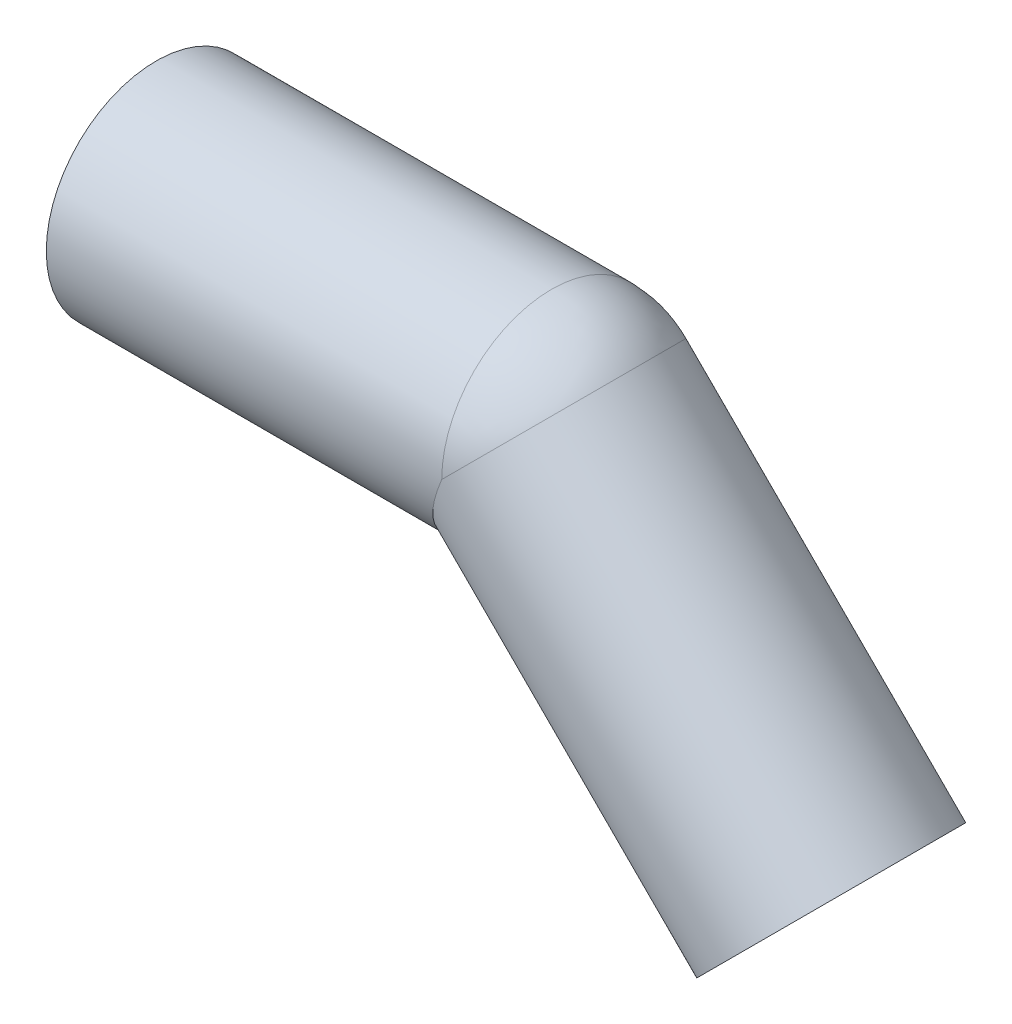
ISO-10303-21;
HEADER;
FILE_DESCRIPTION(('STEP AP214'),'2;1');
FILE_NAME('part.step','',(''),(''),'','','');
FILE_SCHEMA(('AUTOMOTIVE_DESIGN { 1 0 10303 214 1 1 1 1 }'));
ENDSEC;
DATA;
#1=APPLICATION_CONTEXT('core data for automotive mechanical design processes');
#2=APPLICATION_PROTOCOL_DEFINITION('international standard','automotive_design',2000,#1);
#3=PRODUCT_CONTEXT('',#1,'mechanical');
#4=PRODUCT('Part','Part','',(#3));
#5=PRODUCT_RELATED_PRODUCT_CATEGORY('part','',(#4));
#6=PRODUCT_DEFINITION_FORMATION('','',#4);
#7=PRODUCT_DEFINITION_CONTEXT('part definition',#1,'design');
#8=PRODUCT_DEFINITION('design','',#6,#7);
#9=PRODUCT_DEFINITION_SHAPE('','',#8);
#10=(LENGTH_UNIT() NAMED_UNIT(*) SI_UNIT(.MILLI.,.METRE.));
#11=(NAMED_UNIT(*) PLANE_ANGLE_UNIT() SI_UNIT($,.RADIAN.));
#12=(NAMED_UNIT(*) SI_UNIT($,.STERADIAN.) SOLID_ANGLE_UNIT());
#13=UNCERTAINTY_MEASURE_WITH_UNIT(LENGTH_MEASURE(1.E-05),#10,'distance_accuracy_value','');
#14=(GEOMETRIC_REPRESENTATION_CONTEXT(3) GLOBAL_UNCERTAINTY_ASSIGNED_CONTEXT((#13)) GLOBAL_UNIT_ASSIGNED_CONTEXT((#10,
#11,#12)) REPRESENTATION_CONTEXT('',''));
#15=CARTESIAN_POINT('',(0.,0.,0.));
#16=DIRECTION('',(0.,0.,1.));
#17=DIRECTION('',(1.,0.,0.));
#18=AXIS2_PLACEMENT_3D('',#15,#16,#17);
#19=CARTESIAN_POINT('',(76.8198051533945,-31.8198051533949,0.));
#20=DIRECTION('',(-0.70710678118654,0.707106781186555,0.));
#21=DIRECTION('',(-0.707106781186555,-0.70710678118654,0.));
#22=AXIS2_PLACEMENT_3D('',#19,#20,#21);
#23=CYLINDRICAL_SURFACE('',#22,10.6);
#24=CARTESIAN_POINT('',(45.,0.,0.));
#25=DIRECTION('',(0.707106781186547,-0.707106781186548,0.));
#26=DIRECTION('',(0.,0.,-1.));
#27=AXIS2_PLACEMENT_3D('',#24,#25,#26);
#28=CIRCLE('',#27,10.6);
#29=CARTESIAN_POINT('',(52.4953318809489,7.49533188020596,0.));
#30=VERTEX_POINT('',#29);
#31=CARTESIAN_POINT('',(45.0000000000002,-1.07196793468043E-13,10.6));
#32=VERTEX_POINT('',#31);
#33=EDGE_CURVE('E53',#30,#32,#28,.T.);
#34=ORIENTED_EDGE('',*,*,#33,.F.);
#35=CARTESIAN_POINT('',(45.,0.,0.));
#36=DIRECTION('',(0.707106781081423,-0.707106781291672,0.));
#37=DIRECTION('',(0.,0.,-1.));
#38=AXIS2_PLACEMENT_3D('',#35,#36,#37);
#39=CIRCLE('',#38,10.6);
#40=CARTESIAN_POINT('',(45.0000000000003,-1.15468951267044E-13,-10.6));
#41=VERTEX_POINT('',#40);
#42=EDGE_CURVE('E46',#41,#30,#39,.T.);
#43=ORIENTED_EDGE('',*,*,#42,.F.);
#44=CARTESIAN_POINT('',(45.0000000000003,0.,0.));
#45=DIRECTION('',(-0.923879532511285,0.382683432365095,0.));
#46=DIRECTION('',(-0.382683432365095,-0.923879532511285,0.));
#47=AXIS2_PLACEMENT_3D('',#44,#45,#46);
#48=ELLIPSE('',#47,11.4733573230994,10.6);
#49=EDGE_CURVE('E55',#32,#41,#48,.F.);
#50=ORIENTED_EDGE('',*,*,#49,.F.);
#51=EDGE_LOOP('',(#34,#43,#50));
#52=FACE_BOUND('',#51,.T.);
#53=CARTESIAN_POINT('',(76.8198051533943,-31.8198051533947,0.));
#54=DIRECTION('',(-0.70710678118654,0.707106781186555,0.));
#55=DIRECTION('',(-0.707106781186555,-0.70710678118654,0.));
#56=AXIS2_PLACEMENT_3D('',#53,#54,#55);
#57=CIRCLE('',#56,10.6);
#58=CARTESIAN_POINT('',(69.3244732728168,-39.3151370339721,0.));
#59=VERTEX_POINT('',#58);
#60=EDGE_CURVE('E18',#59,#59,#57,.T.);
#61=ORIENTED_EDGE('',*,*,#60,.F.);
#62=EDGE_LOOP('',(#61));
#63=FACE_BOUND('',#62,.T.);
#64=ADVANCED_FACE('F15',(#52,#63),#23,.F.);
#65=CARTESIAN_POINT('',(45.,0.,0.));
#66=DIRECTION('',(0.,0.,1.));
#67=DIRECTION('',(-1.,0.,0.));
#68=AXIS2_PLACEMENT_3D('',#65,#66,#67);
#69=SPHERICAL_SURFACE('',#68,10.6);
#70=CARTESIAN_POINT('',(45.,0.,0.));
#71=DIRECTION('',(-1.,0.,0.));
#72=DIRECTION('',(0.,1.,0.));
#73=AXIS2_PLACEMENT_3D('',#70,#71,#72);
#74=CIRCLE('',#73,10.6);
#75=EDGE_CURVE('E51',#41,#32,#74,.F.);
#76=ORIENTED_EDGE('',*,*,#75,.F.);
#77=ORIENTED_EDGE('',*,*,#42,.T.);
#78=ORIENTED_EDGE('',*,*,#33,.T.);
#79=EDGE_LOOP('',(#76,#77,#78));
#80=FACE_BOUND('',#79,.T.);
#81=ADVANCED_FACE('F58',(#80),#69,.F.);
#82=CARTESIAN_POINT('',(85.6586399182278,-22.9809703885614,12.6500021083315));
#83=DIRECTION('',(0.707106781186547,-0.707106781186548,0.));
#84=DIRECTION('',(-0.707106781186548,-0.707106781186547,0.));
#85=AXIS2_PLACEMENT_3D('',#82,#83,#84);
#86=PLANE('',#85);
#87=ORIENTED_EDGE('',*,*,#60,.T.);
#88=EDGE_LOOP('',(#87));
#89=FACE_BOUND('',#88,.T.);
#90=CARTESIAN_POINT('',(76.8198051533941,-31.8198051533948,0.));
#91=DIRECTION('',(-0.707106781186532,0.707106781186563,0.));
#92=DIRECTION('',(-0.707106781186563,-0.707106781186532,0.));
#93=AXIS2_PLACEMENT_3D('',#90,#91,#92);
#94=CIRCLE('',#93,12.5);
#95=CARTESIAN_POINT('',(67.980970388562,-40.6586399182265,0.));
#96=VERTEX_POINT('',#95);
#97=EDGE_CURVE('E75',#96,#96,#94,.T.);
#98=ORIENTED_EDGE('',*,*,#97,.F.);
#99=EDGE_LOOP('',(#98));
#100=FACE_BOUND('',#99,.T.);
#101=ADVANCED_FACE('F85',(#89,#100),#86,.T.);
#102=CARTESIAN_POINT('',(45.,0.,0.));
#103=DIRECTION('',(-1.,0.,0.));
#104=DIRECTION('',(0.,0.,1.));
#105=AXIS2_PLACEMENT_3D('',#102,#103,#104);
#106=CYLINDRICAL_SURFACE('',#105,10.6);
#107=CARTESIAN_POINT('',(0.,0.,0.));
#108=DIRECTION('',(-1.,0.,0.));
#109=DIRECTION('',(0.,0.,1.));
#110=AXIS2_PLACEMENT_3D('',#107,#108,#109);
#111=CIRCLE('',#110,10.6);
#112=CARTESIAN_POINT('',(0.,0.,10.6));
#113=VERTEX_POINT('',#112);
#114=EDGE_CURVE('E72',#113,#113,#111,.F.);
#115=ORIENTED_EDGE('',*,*,#114,.F.);
#116=EDGE_LOOP('',(#115));
#117=FACE_BOUND('',#116,.T.);
#118=ORIENTED_EDGE('',*,*,#49,.T.);
#119=ORIENTED_EDGE('',*,*,#75,.T.);
#120=EDGE_LOOP('',(#118,#119));
#121=FACE_BOUND('',#120,.T.);
#122=ADVANCED_FACE('F88',(#117,#121),#106,.F.);
#123=CARTESIAN_POINT('',(45.,0.,0.));
#124=DIRECTION('',(0.,0.,1.));
#125=DIRECTION('',(1.,0.,0.));
#126=AXIS2_PLACEMENT_3D('',#123,#124,#125);
#127=SPHERICAL_SURFACE('',#126,12.5);
#128=CARTESIAN_POINT('',(45.,0.,0.));
#129=DIRECTION('',(-1.,0.,0.));
#130=DIRECTION('',(0.,1.,0.));
#131=AXIS2_PLACEMENT_3D('',#128,#129,#130);
#132=CIRCLE('',#131,12.5);
#133=CARTESIAN_POINT('',(45.0000000000005,-2.15515710602571E-13,12.5));
#134=VERTEX_POINT('',#133);
#135=CARTESIAN_POINT('',(45.0000000000005,-2.08607865924848E-13,-12.4999999999999));
#136=VERTEX_POINT('',#135);
#137=EDGE_CURVE('E71',#134,#136,#132,.T.);
#138=ORIENTED_EDGE('',*,*,#137,.F.);
#139=CARTESIAN_POINT('',(45.,0.,0.));
#140=DIRECTION('',(-0.707106781112542,0.707106781260553,0.));
#141=DIRECTION('',(0.,0.,1.));
#142=AXIS2_PLACEMENT_3D('',#139,#140,#141);
#143=CIRCLE('',#142,12.5);
#144=CARTESIAN_POINT('',(53.8388347652945,8.83883476436921,0.));
#145=VERTEX_POINT('',#144);
#146=EDGE_CURVE('E77',#134,#145,#143,.T.);
#147=ORIENTED_EDGE('',*,*,#146,.T.);
#148=CARTESIAN_POINT('',(45.0000000000003,3.19189119579733E-13,0.));
#149=DIRECTION('',(-0.707106781186533,0.707106781186562,0.));
#150=DIRECTION('',(0.707106781186562,0.707106781186533,0.));
#151=AXIS2_PLACEMENT_3D('',#148,#149,#150);
#152=CIRCLE('',#151,12.4999999999995);
#153=EDGE_CURVE('E33',#136,#145,#152,.F.);
#154=ORIENTED_EDGE('',*,*,#153,.F.);
#155=EDGE_LOOP('',(#138,#147,#154));
#156=FACE_BOUND('',#155,.T.);
#157=ADVANCED_FACE('F92',(#156),#127,.T.);
#158=CARTESIAN_POINT('',(45.0000000000003,3.13984949151802E-13,0.));
#159=DIRECTION('',(-0.707106781186532,0.707106781186563,0.));
#160=DIRECTION('',(-0.707106781186563,-0.707106781186532,0.));
#161=AXIS2_PLACEMENT_3D('',#158,#159,#160);
#162=CYLINDRICAL_SURFACE('',#161,12.5);
#163=ORIENTED_EDGE('',*,*,#97,.T.);
#164=EDGE_LOOP('',(#163));
#165=FACE_BOUND('',#164,.T.);
#166=CARTESIAN_POINT('',(45.0000000000006,0.,0.));
#167=DIRECTION('',(-0.923879532511283,0.3826834323651,0.));
#168=DIRECTION('',(-0.3826834323651,-0.923879532511283,0.));
#169=AXIS2_PLACEMENT_3D('',#166,#167,#168);
#170=ELLIPSE('',#169,13.529902503655,12.5);
#171=EDGE_CURVE('E24',#136,#134,#170,.T.);
#172=ORIENTED_EDGE('',*,*,#171,.F.);
#173=ORIENTED_EDGE('',*,*,#153,.T.);
#174=ORIENTED_EDGE('',*,*,#146,.F.);
#175=EDGE_LOOP('',(#172,#173,#174));
#176=FACE_BOUND('',#175,.T.);
#177=ADVANCED_FACE('F97',(#165,#176),#162,.T.);
#178=CARTESIAN_POINT('',(0.,-12.5,12.6500021083521));
#179=DIRECTION('',(-1.,0.,0.));
#180=DIRECTION('',(0.,1.,0.));
#181=AXIS2_PLACEMENT_3D('',#178,#179,#180);
#182=PLANE('',#181);
#183=ORIENTED_EDGE('',*,*,#114,.T.);
#184=EDGE_LOOP('',(#183));
#185=FACE_BOUND('',#184,.T.);
#186=CARTESIAN_POINT('',(0.,0.,0.));
#187=DIRECTION('',(-1.,0.,0.));
#188=DIRECTION('',(0.,0.,1.));
#189=AXIS2_PLACEMENT_3D('',#186,#187,#188);
#190=CIRCLE('',#189,12.5);
#191=CARTESIAN_POINT('',(0.,0.,12.5));
#192=VERTEX_POINT('',#191);
#193=EDGE_CURVE('E9',#192,#192,#190,.F.);
#194=ORIENTED_EDGE('',*,*,#193,.F.);
#195=EDGE_LOOP('',(#194));
#196=FACE_BOUND('',#195,.T.);
#197=ADVANCED_FACE('F113',(#185,#196),#182,.T.);
#198=CARTESIAN_POINT('',(0.,0.,0.));
#199=DIRECTION('',(-1.,0.,0.));
#200=DIRECTION('',(0.,0.,1.));
#201=AXIS2_PLACEMENT_3D('',#198,#199,#200);
#202=CYLINDRICAL_SURFACE('',#201,12.5);
#203=ORIENTED_EDGE('',*,*,#171,.T.);
#204=ORIENTED_EDGE('',*,*,#137,.T.);
#205=EDGE_LOOP('',(#203,#204));
#206=FACE_BOUND('',#205,.T.);
#207=ORIENTED_EDGE('',*,*,#193,.T.);
#208=EDGE_LOOP('',(#207));
#209=FACE_BOUND('',#208,.T.);
#210=ADVANCED_FACE('F110',(#206,#209),#202,.T.);
#211=CLOSED_SHELL('',(#64,#81,#101,#122,#157,#177,#197,#210));
#212=MANIFOLD_SOLID_BREP('B1',#211);
#213=ADVANCED_BREP_SHAPE_REPRESENTATION('',(#18,#212),#14);
#214=SHAPE_DEFINITION_REPRESENTATION(#9,#213);
ENDSEC;
END-ISO-10303-21;
